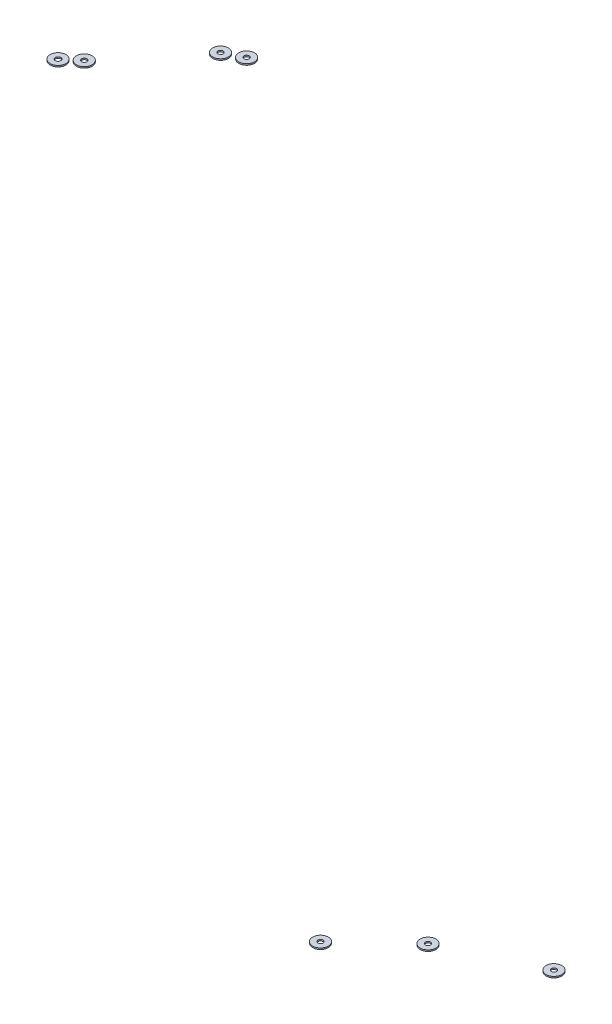
ISO-10303-21;
HEADER;
FILE_DESCRIPTION(('STEP AP214'),'2;1');
FILE_NAME('part.step','',(''),(''),'','','');
FILE_SCHEMA(('AUTOMOTIVE_DESIGN { 1 0 10303 214 1 1 1 1 }'));
ENDSEC;
DATA;
#1=APPLICATION_CONTEXT('core data for automotive mechanical design processes');
#2=APPLICATION_PROTOCOL_DEFINITION('international standard','automotive_design',2000,#1);
#3=PRODUCT_CONTEXT('',#1,'mechanical');
#4=PRODUCT('Part','Part','',(#3));
#5=PRODUCT_RELATED_PRODUCT_CATEGORY('part','',(#4));
#6=PRODUCT_DEFINITION_FORMATION('','',#4);
#7=PRODUCT_DEFINITION_CONTEXT('part definition',#1,'design');
#8=PRODUCT_DEFINITION('design','',#6,#7);
#9=PRODUCT_DEFINITION_SHAPE('','',#8);
#10=(LENGTH_UNIT() NAMED_UNIT(*) SI_UNIT(.MILLI.,.METRE.));
#11=(NAMED_UNIT(*) PLANE_ANGLE_UNIT() SI_UNIT($,.RADIAN.));
#12=(NAMED_UNIT(*) SI_UNIT($,.STERADIAN.) SOLID_ANGLE_UNIT());
#13=UNCERTAINTY_MEASURE_WITH_UNIT(LENGTH_MEASURE(1.E-05),#10,'distance_accuracy_value','');
#14=(GEOMETRIC_REPRESENTATION_CONTEXT(3) GLOBAL_UNCERTAINTY_ASSIGNED_CONTEXT((#13)) GLOBAL_UNIT_ASSIGNED_CONTEXT((#10,
#11,#12)) REPRESENTATION_CONTEXT('',''));
#15=CARTESIAN_POINT('',(0.,0.,0.));
#16=DIRECTION('',(0.,0.,1.));
#17=DIRECTION('',(1.,0.,0.));
#18=AXIS2_PLACEMENT_3D('',#15,#16,#17);
#19=CARTESIAN_POINT('',(-289.687055909534,293.9,282.424125212571));
#20=DIRECTION('',(0.,-1.,0.));
#21=DIRECTION('',(0.,0.,-1.));
#22=AXIS2_PLACEMENT_3D('',#19,#20,#21);
#23=PLANE('',#22);
#24=CARTESIAN_POINT('',(-289.687055909534,293.9,282.424125212571));
#25=DIRECTION('',(0.,-1.,0.));
#26=DIRECTION('',(0.,0.,-1.));
#27=AXIS2_PLACEMENT_3D('',#24,#25,#26);
#28=CIRCLE('',#27,4.50000000000002);
#29=CARTESIAN_POINT('',(-289.687055909534,293.9,277.924125212571));
#30=VERTEX_POINT('',#29);
#31=EDGE_CURVE('E11',#30,#30,#28,.T.);
#32=ORIENTED_EDGE('',*,*,#31,.T.);
#33=EDGE_LOOP('',(#32));
#34=FACE_BOUND('',#33,.T.);
#35=CARTESIAN_POINT('',(-289.687055909534,293.9,282.424125212571));
#36=DIRECTION('',(0.,-1.,0.));
#37=DIRECTION('',(0.,0.,-1.));
#38=AXIS2_PLACEMENT_3D('',#35,#36,#37);
#39=CIRCLE('',#38,1.50000000000002);
#40=CARTESIAN_POINT('',(-289.687055909534,293.9,280.924125212571));
#41=VERTEX_POINT('',#40);
#42=EDGE_CURVE('E53',#41,#41,#39,.T.);
#43=ORIENTED_EDGE('',*,*,#42,.F.);
#44=EDGE_LOOP('',(#43));
#45=FACE_BOUND('',#44,.T.);
#46=ADVANCED_FACE('F42',(#34,#45),#23,.T.);
#47=CARTESIAN_POINT('',(-289.687055909534,294.7,282.424125212571));
#48=DIRECTION('',(0.,-1.,0.));
#49=DIRECTION('',(0.,0.,-1.));
#50=AXIS2_PLACEMENT_3D('',#47,#48,#49);
#51=PLANE('',#50);
#52=CARTESIAN_POINT('',(-289.687055909534,294.7,282.424125212571));
#53=DIRECTION('',(0.,-1.,0.));
#54=DIRECTION('',(0.,0.,-1.));
#55=AXIS2_PLACEMENT_3D('',#52,#53,#54);
#56=CIRCLE('',#55,4.50000000000002);
#57=CARTESIAN_POINT('',(-289.687055909534,294.7,277.924125212571));
#58=VERTEX_POINT('',#57);
#59=EDGE_CURVE('E46',#58,#58,#56,.T.);
#60=ORIENTED_EDGE('',*,*,#59,.F.);
#61=EDGE_LOOP('',(#60));
#62=FACE_BOUND('',#61,.T.);
#63=CARTESIAN_POINT('',(-289.687055909534,294.7,282.424125212571));
#64=DIRECTION('',(0.,-1.,0.));
#65=DIRECTION('',(0.,0.,-1.));
#66=AXIS2_PLACEMENT_3D('',#63,#64,#65);
#67=CIRCLE('',#66,1.50000000000002);
#68=CARTESIAN_POINT('',(-289.687055909534,294.7,280.924125212571));
#69=VERTEX_POINT('',#68);
#70=EDGE_CURVE('E55',#69,#69,#67,.T.);
#71=ORIENTED_EDGE('',*,*,#70,.T.);
#72=EDGE_LOOP('',(#71));
#73=FACE_BOUND('',#72,.T.);
#74=ADVANCED_FACE('F65',(#62,#73),#51,.F.);
#75=CARTESIAN_POINT('',(-289.687055909534,293.9,282.424125212571));
#76=DIRECTION('',(0.,1.,0.));
#77=DIRECTION('',(0.,0.,1.));
#78=AXIS2_PLACEMENT_3D('',#75,#76,#77);
#79=CYLINDRICAL_SURFACE('',#78,4.50000000000002);
#80=ORIENTED_EDGE('',*,*,#31,.F.);
#81=EDGE_LOOP('',(#80));
#82=FACE_BOUND('',#81,.T.);
#83=ORIENTED_EDGE('',*,*,#59,.T.);
#84=EDGE_LOOP('',(#83));
#85=FACE_BOUND('',#84,.T.);
#86=ADVANCED_FACE('F44',(#82,#85),#79,.T.);
#87=CARTESIAN_POINT('',(-289.687055909534,293.9,282.424125212571));
#88=DIRECTION('',(0.,1.,0.));
#89=DIRECTION('',(0.,0.,1.));
#90=AXIS2_PLACEMENT_3D('',#87,#88,#89);
#91=CYLINDRICAL_SURFACE('',#90,1.50000000000002);
#92=ORIENTED_EDGE('',*,*,#42,.T.);
#93=EDGE_LOOP('',(#92));
#94=FACE_BOUND('',#93,.T.);
#95=ORIENTED_EDGE('',*,*,#70,.F.);
#96=EDGE_LOOP('',(#95));
#97=FACE_BOUND('',#96,.T.);
#98=ADVANCED_FACE('F61',(#94,#97),#91,.F.);
#99=CLOSED_SHELL('',(#46,#74,#86,#98));
#100=MANIFOLD_SOLID_BREP('B2',#99);
#101=CARTESIAN_POINT('',(-339.082998520851,293.9,305.429754445409));
#102=DIRECTION('',(0.,-1.,0.));
#103=DIRECTION('',(0.,0.,-1.));
#104=AXIS2_PLACEMENT_3D('',#101,#102,#103);
#105=PLANE('',#104);
#106=CARTESIAN_POINT('',(-339.082998520851,293.9,305.429754445409));
#107=DIRECTION('',(0.,-1.,0.));
#108=DIRECTION('',(0.,0.,-1.));
#109=AXIS2_PLACEMENT_3D('',#106,#107,#108);
#110=CIRCLE('',#109,4.50000000000002);
#111=CARTESIAN_POINT('',(-339.082998520851,293.9,300.929754445409));
#112=VERTEX_POINT('',#111);
#113=EDGE_CURVE('E41',#112,#112,#110,.T.);
#114=ORIENTED_EDGE('',*,*,#113,.T.);
#115=EDGE_LOOP('',(#114));
#116=FACE_BOUND('',#115,.T.);
#117=CARTESIAN_POINT('',(-339.082998520851,293.9,305.429754445409));
#118=DIRECTION('',(0.,-1.,0.));
#119=DIRECTION('',(0.,0.,-1.));
#120=AXIS2_PLACEMENT_3D('',#117,#118,#119);
#121=CIRCLE('',#120,1.50000000000002);
#122=CARTESIAN_POINT('',(-339.082998520851,293.9,303.929754445409));
#123=VERTEX_POINT('',#122);
#124=EDGE_CURVE('E123',#123,#123,#121,.T.);
#125=ORIENTED_EDGE('',*,*,#124,.F.);
#126=EDGE_LOOP('',(#125));
#127=FACE_BOUND('',#126,.T.);
#128=ADVANCED_FACE('F112',(#116,#127),#105,.T.);
#129=CARTESIAN_POINT('',(-339.082998520851,294.7,305.429754445409));
#130=DIRECTION('',(0.,-1.,0.));
#131=DIRECTION('',(0.,0.,-1.));
#132=AXIS2_PLACEMENT_3D('',#129,#130,#131);
#133=PLANE('',#132);
#134=CARTESIAN_POINT('',(-339.082998520851,294.7,305.429754445409));
#135=DIRECTION('',(0.,-1.,0.));
#136=DIRECTION('',(0.,0.,-1.));
#137=AXIS2_PLACEMENT_3D('',#134,#135,#136);
#138=CIRCLE('',#137,4.50000000000002);
#139=CARTESIAN_POINT('',(-339.082998520851,294.7,300.929754445409));
#140=VERTEX_POINT('',#139);
#141=EDGE_CURVE('E116',#140,#140,#138,.T.);
#142=ORIENTED_EDGE('',*,*,#141,.F.);
#143=EDGE_LOOP('',(#142));
#144=FACE_BOUND('',#143,.T.);
#145=CARTESIAN_POINT('',(-339.082998520851,294.7,305.429754445409));
#146=DIRECTION('',(0.,-1.,0.));
#147=DIRECTION('',(0.,0.,-1.));
#148=AXIS2_PLACEMENT_3D('',#145,#146,#147);
#149=CIRCLE('',#148,1.50000000000002);
#150=CARTESIAN_POINT('',(-339.082998520851,294.7,303.929754445409));
#151=VERTEX_POINT('',#150);
#152=EDGE_CURVE('E125',#151,#151,#149,.T.);
#153=ORIENTED_EDGE('',*,*,#152,.T.);
#154=EDGE_LOOP('',(#153));
#155=FACE_BOUND('',#154,.T.);
#156=ADVANCED_FACE('F135',(#144,#155),#133,.F.);
#157=CARTESIAN_POINT('',(-339.082998520851,293.9,305.429754445409));
#158=DIRECTION('',(0.,1.,0.));
#159=DIRECTION('',(0.,0.,1.));
#160=AXIS2_PLACEMENT_3D('',#157,#158,#159);
#161=CYLINDRICAL_SURFACE('',#160,4.50000000000002);
#162=ORIENTED_EDGE('',*,*,#113,.F.);
#163=EDGE_LOOP('',(#162));
#164=FACE_BOUND('',#163,.T.);
#165=ORIENTED_EDGE('',*,*,#141,.T.);
#166=EDGE_LOOP('',(#165));
#167=FACE_BOUND('',#166,.T.);
#168=ADVANCED_FACE('F114',(#164,#167),#161,.T.);
#169=CARTESIAN_POINT('',(-339.082998520851,293.9,305.429754445409));
#170=DIRECTION('',(0.,1.,0.));
#171=DIRECTION('',(0.,0.,1.));
#172=AXIS2_PLACEMENT_3D('',#169,#170,#171);
#173=CYLINDRICAL_SURFACE('',#172,1.50000000000002);
#174=ORIENTED_EDGE('',*,*,#124,.T.);
#175=EDGE_LOOP('',(#174));
#176=FACE_BOUND('',#175,.T.);
#177=ORIENTED_EDGE('',*,*,#152,.F.);
#178=EDGE_LOOP('',(#177));
#179=FACE_BOUND('',#178,.T.);
#180=ADVANCED_FACE('F131',(#176,#179),#173,.F.);
#181=CLOSED_SHELL('',(#128,#156,#168,#180));
#182=MANIFOLD_SOLID_BREP('B6',#181);
#183=CARTESIAN_POINT('',(-370.956911026411,293.9,335.367132453118));
#184=DIRECTION('',(0.,-1.,0.));
#185=DIRECTION('',(0.,0.,-1.));
#186=AXIS2_PLACEMENT_3D('',#183,#184,#185);
#187=PLANE('',#186);
#188=CARTESIAN_POINT('',(-370.956911026411,293.9,335.367132453118));
#189=DIRECTION('',(0.,-1.,0.));
#190=DIRECTION('',(0.,0.,-1.));
#191=AXIS2_PLACEMENT_3D('',#188,#189,#190);
#192=CIRCLE('',#191,4.50000000000002);
#193=CARTESIAN_POINT('',(-370.956911026411,293.9,330.867132453118));
#194=VERTEX_POINT('',#193);
#195=EDGE_CURVE('E111',#194,#194,#192,.T.);
#196=ORIENTED_EDGE('',*,*,#195,.T.);
#197=EDGE_LOOP('',(#196));
#198=FACE_BOUND('',#197,.T.);
#199=CARTESIAN_POINT('',(-370.956911026411,293.9,335.367132453118));
#200=DIRECTION('',(0.,-1.,0.));
#201=DIRECTION('',(0.,0.,-1.));
#202=AXIS2_PLACEMENT_3D('',#199,#200,#201);
#203=CIRCLE('',#202,1.50000000000002);
#204=CARTESIAN_POINT('',(-370.956911026411,293.9,333.867132453118));
#205=VERTEX_POINT('',#204);
#206=EDGE_CURVE('E193',#205,#205,#203,.T.);
#207=ORIENTED_EDGE('',*,*,#206,.F.);
#208=EDGE_LOOP('',(#207));
#209=FACE_BOUND('',#208,.T.);
#210=ADVANCED_FACE('F182',(#198,#209),#187,.T.);
#211=CARTESIAN_POINT('',(-370.956911026411,294.7,335.367132453118));
#212=DIRECTION('',(0.,-1.,0.));
#213=DIRECTION('',(0.,0.,-1.));
#214=AXIS2_PLACEMENT_3D('',#211,#212,#213);
#215=PLANE('',#214);
#216=CARTESIAN_POINT('',(-370.956911026411,294.7,335.367132453118));
#217=DIRECTION('',(0.,-1.,0.));
#218=DIRECTION('',(0.,0.,-1.));
#219=AXIS2_PLACEMENT_3D('',#216,#217,#218);
#220=CIRCLE('',#219,4.50000000000002);
#221=CARTESIAN_POINT('',(-370.956911026411,294.7,330.867132453118));
#222=VERTEX_POINT('',#221);
#223=EDGE_CURVE('E186',#222,#222,#220,.T.);
#224=ORIENTED_EDGE('',*,*,#223,.F.);
#225=EDGE_LOOP('',(#224));
#226=FACE_BOUND('',#225,.T.);
#227=CARTESIAN_POINT('',(-370.956911026411,294.7,335.367132453118));
#228=DIRECTION('',(0.,-1.,0.));
#229=DIRECTION('',(0.,0.,-1.));
#230=AXIS2_PLACEMENT_3D('',#227,#228,#229);
#231=CIRCLE('',#230,1.50000000000002);
#232=CARTESIAN_POINT('',(-370.956911026411,294.7,333.867132453118));
#233=VERTEX_POINT('',#232);
#234=EDGE_CURVE('E195',#233,#233,#231,.T.);
#235=ORIENTED_EDGE('',*,*,#234,.T.);
#236=EDGE_LOOP('',(#235));
#237=FACE_BOUND('',#236,.T.);
#238=ADVANCED_FACE('F205',(#226,#237),#215,.F.);
#239=CARTESIAN_POINT('',(-370.956911026411,293.9,335.367132453118));
#240=DIRECTION('',(0.,1.,0.));
#241=DIRECTION('',(0.,0.,1.));
#242=AXIS2_PLACEMENT_3D('',#239,#240,#241);
#243=CYLINDRICAL_SURFACE('',#242,4.50000000000002);
#244=ORIENTED_EDGE('',*,*,#195,.F.);
#245=EDGE_LOOP('',(#244));
#246=FACE_BOUND('',#245,.T.);
#247=ORIENTED_EDGE('',*,*,#223,.T.);
#248=EDGE_LOOP('',(#247));
#249=FACE_BOUND('',#248,.T.);
#250=ADVANCED_FACE('F184',(#246,#249),#243,.T.);
#251=CARTESIAN_POINT('',(-370.956911026411,293.9,335.367132453118));
#252=DIRECTION('',(0.,1.,0.));
#253=DIRECTION('',(0.,0.,1.));
#254=AXIS2_PLACEMENT_3D('',#251,#252,#253);
#255=CYLINDRICAL_SURFACE('',#254,1.50000000000002);
#256=ORIENTED_EDGE('',*,*,#206,.T.);
#257=EDGE_LOOP('',(#256));
#258=FACE_BOUND('',#257,.T.);
#259=ORIENTED_EDGE('',*,*,#234,.F.);
#260=EDGE_LOOP('',(#259));
#261=FACE_BOUND('',#260,.T.);
#262=ADVANCED_FACE('F201',(#258,#261),#255,.F.);
#263=CLOSED_SHELL('',(#210,#238,#250,#262));
#264=MANIFOLD_SOLID_BREP('B36',#263);
#265=CARTESIAN_POINT('',(-474.449169572246,706.1,382.793687092254));
#266=DIRECTION('',(0.,1.,0.));
#267=DIRECTION('',(0.,0.,1.));
#268=AXIS2_PLACEMENT_3D('',#265,#266,#267);
#269=PLANE('',#268);
#270=CARTESIAN_POINT('',(-474.449169572246,706.1,382.793687092254));
#271=DIRECTION('',(0.,1.,0.));
#272=DIRECTION('',(0.,0.,1.));
#273=AXIS2_PLACEMENT_3D('',#270,#271,#272);
#274=CIRCLE('',#273,4.50000000000002);
#275=CARTESIAN_POINT('',(-474.449169572246,706.1,387.293687092254));
#276=VERTEX_POINT('',#275);
#277=EDGE_CURVE('E181',#276,#276,#274,.T.);
#278=ORIENTED_EDGE('',*,*,#277,.T.);
#279=EDGE_LOOP('',(#278));
#280=FACE_BOUND('',#279,.T.);
#281=CARTESIAN_POINT('',(-474.449169572246,706.1,382.793687092254));
#282=DIRECTION('',(0.,1.,0.));
#283=DIRECTION('',(0.,0.,1.));
#284=AXIS2_PLACEMENT_3D('',#281,#282,#283);
#285=CIRCLE('',#284,1.6059145248098);
#286=CARTESIAN_POINT('',(-474.449169572246,706.1,384.399601617063));
#287=VERTEX_POINT('',#286);
#288=EDGE_CURVE('E263',#287,#287,#285,.T.);
#289=ORIENTED_EDGE('',*,*,#288,.F.);
#290=EDGE_LOOP('',(#289));
#291=FACE_BOUND('',#290,.T.);
#292=ADVANCED_FACE('F252',(#280,#291),#269,.T.);
#293=CARTESIAN_POINT('',(-474.449169572246,705.3,382.793687092254));
#294=DIRECTION('',(0.,1.,0.));
#295=DIRECTION('',(0.,0.,1.));
#296=AXIS2_PLACEMENT_3D('',#293,#294,#295);
#297=PLANE('',#296);
#298=CARTESIAN_POINT('',(-474.449169572246,705.3,382.793687092254));
#299=DIRECTION('',(0.,1.,0.));
#300=DIRECTION('',(0.,0.,1.));
#301=AXIS2_PLACEMENT_3D('',#298,#299,#300);
#302=CIRCLE('',#301,4.50000000000002);
#303=CARTESIAN_POINT('',(-474.449169572246,705.3,387.293687092254));
#304=VERTEX_POINT('',#303);
#305=EDGE_CURVE('E256',#304,#304,#302,.T.);
#306=ORIENTED_EDGE('',*,*,#305,.F.);
#307=EDGE_LOOP('',(#306));
#308=FACE_BOUND('',#307,.T.);
#309=CARTESIAN_POINT('',(-474.449169572246,705.3,382.793687092254));
#310=DIRECTION('',(0.,1.,0.));
#311=DIRECTION('',(0.,0.,1.));
#312=AXIS2_PLACEMENT_3D('',#309,#310,#311);
#313=CIRCLE('',#312,1.6059145248098);
#314=CARTESIAN_POINT('',(-474.449169572246,705.3,384.399601617063));
#315=VERTEX_POINT('',#314);
#316=EDGE_CURVE('E265',#315,#315,#313,.T.);
#317=ORIENTED_EDGE('',*,*,#316,.T.);
#318=EDGE_LOOP('',(#317));
#319=FACE_BOUND('',#318,.T.);
#320=ADVANCED_FACE('F275',(#308,#319),#297,.F.);
#321=CARTESIAN_POINT('',(-474.449169572246,706.1,382.793687092254));
#322=DIRECTION('',(0.,-1.,0.));
#323=DIRECTION('',(0.,0.,-1.));
#324=AXIS2_PLACEMENT_3D('',#321,#322,#323);
#325=CYLINDRICAL_SURFACE('',#324,4.50000000000002);
#326=ORIENTED_EDGE('',*,*,#277,.F.);
#327=EDGE_LOOP('',(#326));
#328=FACE_BOUND('',#327,.T.);
#329=ORIENTED_EDGE('',*,*,#305,.T.);
#330=EDGE_LOOP('',(#329));
#331=FACE_BOUND('',#330,.T.);
#332=ADVANCED_FACE('F254',(#328,#331),#325,.T.);
#333=CARTESIAN_POINT('',(-474.449169572246,706.1,382.793687092254));
#334=DIRECTION('',(0.,-1.,0.));
#335=DIRECTION('',(0.,0.,-1.));
#336=AXIS2_PLACEMENT_3D('',#333,#334,#335);
#337=CYLINDRICAL_SURFACE('',#336,1.6059145248098);
#338=ORIENTED_EDGE('',*,*,#288,.T.);
#339=EDGE_LOOP('',(#338));
#340=FACE_BOUND('',#339,.T.);
#341=ORIENTED_EDGE('',*,*,#316,.F.);
#342=EDGE_LOOP('',(#341));
#343=FACE_BOUND('',#342,.T.);
#344=ADVANCED_FACE('F271',(#340,#343),#337,.F.);
#345=CLOSED_SHELL('',(#292,#320,#332,#344));
#346=MANIFOLD_SOLID_BREP('B106',#345);
#347=CARTESIAN_POINT('',(-466.308050673724,706.1,375.859415010098));
#348=DIRECTION('',(0.,1.,0.));
#349=DIRECTION('',(0.,0.,1.));
#350=AXIS2_PLACEMENT_3D('',#347,#348,#349);
#351=PLANE('',#350);
#352=CARTESIAN_POINT('',(-466.308050673724,706.1,375.859415010098));
#353=DIRECTION('',(0.,1.,0.));
#354=DIRECTION('',(0.,0.,1.));
#355=AXIS2_PLACEMENT_3D('',#352,#353,#354);
#356=CIRCLE('',#355,4.50000000000002);
#357=CARTESIAN_POINT('',(-466.308050673724,706.1,380.359415010098));
#358=VERTEX_POINT('',#357);
#359=EDGE_CURVE('E251',#358,#358,#356,.T.);
#360=ORIENTED_EDGE('',*,*,#359,.T.);
#361=EDGE_LOOP('',(#360));
#362=FACE_BOUND('',#361,.T.);
#363=CARTESIAN_POINT('',(-466.308050673724,706.1,375.859415010098));
#364=DIRECTION('',(0.,1.,0.));
#365=DIRECTION('',(0.,0.,1.));
#366=AXIS2_PLACEMENT_3D('',#363,#364,#365);
#367=CIRCLE('',#366,1.50000000000002);
#368=CARTESIAN_POINT('',(-466.308050673724,706.1,377.359415010098));
#369=VERTEX_POINT('',#368);
#370=EDGE_CURVE('E333',#369,#369,#367,.T.);
#371=ORIENTED_EDGE('',*,*,#370,.F.);
#372=EDGE_LOOP('',(#371));
#373=FACE_BOUND('',#372,.T.);
#374=ADVANCED_FACE('F322',(#362,#373),#351,.T.);
#375=CARTESIAN_POINT('',(-466.308050673724,705.3,375.859415010098));
#376=DIRECTION('',(0.,1.,0.));
#377=DIRECTION('',(0.,0.,1.));
#378=AXIS2_PLACEMENT_3D('',#375,#376,#377);
#379=PLANE('',#378);
#380=CARTESIAN_POINT('',(-466.308050673724,705.3,375.859415010098));
#381=DIRECTION('',(0.,1.,0.));
#382=DIRECTION('',(0.,0.,1.));
#383=AXIS2_PLACEMENT_3D('',#380,#381,#382);
#384=CIRCLE('',#383,4.50000000000002);
#385=CARTESIAN_POINT('',(-466.308050673724,705.3,380.359415010098));
#386=VERTEX_POINT('',#385);
#387=EDGE_CURVE('E326',#386,#386,#384,.T.);
#388=ORIENTED_EDGE('',*,*,#387,.F.);
#389=EDGE_LOOP('',(#388));
#390=FACE_BOUND('',#389,.T.);
#391=CARTESIAN_POINT('',(-466.308050673724,705.3,375.859415010098));
#392=DIRECTION('',(0.,1.,0.));
#393=DIRECTION('',(0.,0.,1.));
#394=AXIS2_PLACEMENT_3D('',#391,#392,#393);
#395=CIRCLE('',#394,1.50000000000002);
#396=CARTESIAN_POINT('',(-466.308050673724,705.3,377.359415010098));
#397=VERTEX_POINT('',#396);
#398=EDGE_CURVE('E335',#397,#397,#395,.T.);
#399=ORIENTED_EDGE('',*,*,#398,.T.);
#400=EDGE_LOOP('',(#399));
#401=FACE_BOUND('',#400,.T.);
#402=ADVANCED_FACE('F345',(#390,#401),#379,.F.);
#403=CARTESIAN_POINT('',(-466.308050673724,706.1,375.859415010098));
#404=DIRECTION('',(0.,-1.,0.));
#405=DIRECTION('',(0.,0.,-1.));
#406=AXIS2_PLACEMENT_3D('',#403,#404,#405);
#407=CYLINDRICAL_SURFACE('',#406,4.50000000000002);
#408=ORIENTED_EDGE('',*,*,#359,.F.);
#409=EDGE_LOOP('',(#408));
#410=FACE_BOUND('',#409,.T.);
#411=ORIENTED_EDGE('',*,*,#387,.T.);
#412=EDGE_LOOP('',(#411));
#413=FACE_BOUND('',#412,.T.);
#414=ADVANCED_FACE('F324',(#410,#413),#407,.T.);
#415=CARTESIAN_POINT('',(-466.308050673724,706.1,375.859415010098));
#416=DIRECTION('',(0.,-1.,0.));
#417=DIRECTION('',(0.,0.,-1.));
#418=AXIS2_PLACEMENT_3D('',#415,#416,#417);
#419=CYLINDRICAL_SURFACE('',#418,1.50000000000002);
#420=ORIENTED_EDGE('',*,*,#370,.T.);
#421=EDGE_LOOP('',(#420));
#422=FACE_BOUND('',#421,.T.);
#423=ORIENTED_EDGE('',*,*,#398,.F.);
#424=EDGE_LOOP('',(#423));
#425=FACE_BOUND('',#424,.T.);
#426=ADVANCED_FACE('F341',(#422,#425),#419,.F.);
#427=CLOSED_SHELL('',(#374,#402,#414,#426));
#428=MANIFOLD_SOLID_BREP('B176',#427);
#429=CARTESIAN_POINT('',(-431.039698401952,706.1,332.774189517311));
#430=DIRECTION('',(0.,1.,0.));
#431=DIRECTION('',(0.,0.,1.));
#432=AXIS2_PLACEMENT_3D('',#429,#430,#431);
#433=PLANE('',#432);
#434=CARTESIAN_POINT('',(-431.039698401952,706.1,332.774189517311));
#435=DIRECTION('',(0.,1.,0.));
#436=DIRECTION('',(0.,0.,1.));
#437=AXIS2_PLACEMENT_3D('',#434,#435,#436);
#438=CIRCLE('',#437,4.50000000000002);
#439=CARTESIAN_POINT('',(-431.039698401952,706.1,337.274189517311));
#440=VERTEX_POINT('',#439);
#441=EDGE_CURVE('E321',#440,#440,#438,.T.);
#442=ORIENTED_EDGE('',*,*,#441,.T.);
#443=EDGE_LOOP('',(#442));
#444=FACE_BOUND('',#443,.T.);
#445=CARTESIAN_POINT('',(-431.039698401952,706.1,332.774189517311));
#446=DIRECTION('',(0.,1.,0.));
#447=DIRECTION('',(0.,0.,1.));
#448=AXIS2_PLACEMENT_3D('',#445,#446,#447);
#449=CIRCLE('',#448,1.49999999999997);
#450=CARTESIAN_POINT('',(-431.039698401952,706.1,334.274189517311));
#451=VERTEX_POINT('',#450);
#452=EDGE_CURVE('E402',#451,#451,#449,.T.);
#453=ORIENTED_EDGE('',*,*,#452,.F.);
#454=EDGE_LOOP('',(#453));
#455=FACE_BOUND('',#454,.T.);
#456=ADVANCED_FACE('F391',(#444,#455),#433,.T.);
#457=CARTESIAN_POINT('',(-431.039698401952,705.3,332.774189517311));
#458=DIRECTION('',(0.,1.,0.));
#459=DIRECTION('',(0.,0.,1.));
#460=AXIS2_PLACEMENT_3D('',#457,#458,#459);
#461=PLANE('',#460);
#462=CARTESIAN_POINT('',(-431.039698401952,705.3,332.774189517311));
#463=DIRECTION('',(0.,1.,0.));
#464=DIRECTION('',(0.,0.,1.));
#465=AXIS2_PLACEMENT_3D('',#462,#463,#464);
#466=CIRCLE('',#465,4.50000000000002);
#467=CARTESIAN_POINT('',(-431.039698401952,705.3,337.274189517311));
#468=VERTEX_POINT('',#467);
#469=EDGE_CURVE('E395',#468,#468,#466,.T.);
#470=ORIENTED_EDGE('',*,*,#469,.F.);
#471=EDGE_LOOP('',(#470));
#472=FACE_BOUND('',#471,.T.);
#473=CARTESIAN_POINT('',(-431.039698401952,705.3,332.774189517311));
#474=DIRECTION('',(0.,1.,0.));
#475=DIRECTION('',(0.,0.,1.));
#476=AXIS2_PLACEMENT_3D('',#473,#474,#475);
#477=CIRCLE('',#476,1.49999999999997);
#478=CARTESIAN_POINT('',(-431.039698401952,705.3,334.274189517311));
#479=VERTEX_POINT('',#478);
#480=EDGE_CURVE('E404',#479,#479,#477,.T.);
#481=ORIENTED_EDGE('',*,*,#480,.T.);
#482=EDGE_LOOP('',(#481));
#483=FACE_BOUND('',#482,.T.);
#484=ADVANCED_FACE('F414',(#472,#483),#461,.F.);
#485=CARTESIAN_POINT('',(-431.039698401952,706.1,332.774189517311));
#486=DIRECTION('',(0.,-1.,0.));
#487=DIRECTION('',(0.,0.,-1.));
#488=AXIS2_PLACEMENT_3D('',#485,#486,#487);
#489=CYLINDRICAL_SURFACE('',#488,4.50000000000002);
#490=ORIENTED_EDGE('',*,*,#441,.F.);
#491=EDGE_LOOP('',(#490));
#492=FACE_BOUND('',#491,.T.);
#493=ORIENTED_EDGE('',*,*,#469,.T.);
#494=EDGE_LOOP('',(#493));
#495=FACE_BOUND('',#494,.T.);
#496=ADVANCED_FACE('F393',(#492,#495),#489,.T.);
#497=CARTESIAN_POINT('',(-431.039698401952,706.1,332.774189517311));
#498=DIRECTION('',(0.,-1.,0.));
#499=DIRECTION('',(0.,0.,-1.));
#500=AXIS2_PLACEMENT_3D('',#497,#498,#499);
#501=CYLINDRICAL_SURFACE('',#500,1.49999999999997);
#502=ORIENTED_EDGE('',*,*,#452,.T.);
#503=EDGE_LOOP('',(#502));
#504=FACE_BOUND('',#503,.T.);
#505=ORIENTED_EDGE('',*,*,#480,.F.);
#506=EDGE_LOOP('',(#505));
#507=FACE_BOUND('',#506,.T.);
#508=ADVANCED_FACE('F410',(#504,#507),#501,.F.);
#509=CLOSED_SHELL('',(#456,#484,#496,#508));
#510=MANIFOLD_SOLID_BREP('B246',#509);
#511=CARTESIAN_POINT('',(-421.090050281492,706.1,327.725114351705));
#512=DIRECTION('',(0.,1.,0.));
#513=DIRECTION('',(0.,0.,1.));
#514=AXIS2_PLACEMENT_3D('',#511,#512,#513);
#515=PLANE('',#514);
#516=CARTESIAN_POINT('',(-421.090050281492,706.1,327.725114351705));
#517=DIRECTION('',(0.,1.,0.));
#518=DIRECTION('',(0.,0.,1.));
#519=AXIS2_PLACEMENT_3D('',#516,#517,#518);
#520=CIRCLE('',#519,4.50000000000002);
#521=CARTESIAN_POINT('',(-421.090050281492,706.1,332.225114351705));
#522=VERTEX_POINT('',#521);
#523=EDGE_CURVE('E390',#522,#522,#520,.T.);
#524=ORIENTED_EDGE('',*,*,#523,.T.);
#525=EDGE_LOOP('',(#524));
#526=FACE_BOUND('',#525,.T.);
#527=CARTESIAN_POINT('',(-421.090050281492,706.1,327.725114351705));
#528=DIRECTION('',(0.,1.,0.));
#529=DIRECTION('',(0.,0.,1.));
#530=AXIS2_PLACEMENT_3D('',#527,#528,#529);
#531=CIRCLE('',#530,1.49999999999997);
#532=CARTESIAN_POINT('',(-421.090050281492,706.1,329.225114351705));
#533=VERTEX_POINT('',#532);
#534=EDGE_CURVE('E464',#533,#533,#531,.T.);
#535=ORIENTED_EDGE('',*,*,#534,.F.);
#536=EDGE_LOOP('',(#535));
#537=FACE_BOUND('',#536,.T.);
#538=ADVANCED_FACE('F453',(#526,#537),#515,.T.);
#539=CARTESIAN_POINT('',(-421.090050281492,705.3,327.725114351705));
#540=DIRECTION('',(0.,1.,0.));
#541=DIRECTION('',(0.,0.,1.));
#542=AXIS2_PLACEMENT_3D('',#539,#540,#541);
#543=PLANE('',#542);
#544=CARTESIAN_POINT('',(-421.090050281492,705.3,327.725114351705));
#545=DIRECTION('',(0.,1.,0.));
#546=DIRECTION('',(0.,0.,1.));
#547=AXIS2_PLACEMENT_3D('',#544,#545,#546);
#548=CIRCLE('',#547,4.50000000000002);
#549=CARTESIAN_POINT('',(-421.090050281492,705.3,332.225114351705));
#550=VERTEX_POINT('',#549);
#551=EDGE_CURVE('E457',#550,#550,#548,.T.);
#552=ORIENTED_EDGE('',*,*,#551,.F.);
#553=EDGE_LOOP('',(#552));
#554=FACE_BOUND('',#553,.T.);
#555=CARTESIAN_POINT('',(-421.090050281492,705.3,327.725114351705));
#556=DIRECTION('',(0.,1.,0.));
#557=DIRECTION('',(0.,0.,1.));
#558=AXIS2_PLACEMENT_3D('',#555,#556,#557);
#559=CIRCLE('',#558,1.49999999999997);
#560=CARTESIAN_POINT('',(-421.090050281492,705.3,329.225114351705));
#561=VERTEX_POINT('',#560);
#562=EDGE_CURVE('E466',#561,#561,#559,.T.);
#563=ORIENTED_EDGE('',*,*,#562,.T.);
#564=EDGE_LOOP('',(#563));
#565=FACE_BOUND('',#564,.T.);
#566=ADVANCED_FACE('F476',(#554,#565),#543,.F.);
#567=CARTESIAN_POINT('',(-421.090050281492,706.1,327.725114351705));
#568=DIRECTION('',(0.,-1.,0.));
#569=DIRECTION('',(0.,0.,-1.));
#570=AXIS2_PLACEMENT_3D('',#567,#568,#569);
#571=CYLINDRICAL_SURFACE('',#570,4.50000000000002);
#572=ORIENTED_EDGE('',*,*,#523,.F.);
#573=EDGE_LOOP('',(#572));
#574=FACE_BOUND('',#573,.T.);
#575=ORIENTED_EDGE('',*,*,#551,.T.);
#576=EDGE_LOOP('',(#575));
#577=FACE_BOUND('',#576,.T.);
#578=ADVANCED_FACE('F455',(#574,#577),#571,.T.);
#579=CARTESIAN_POINT('',(-421.090050281492,706.1,327.725114351705));
#580=DIRECTION('',(0.,-1.,0.));
#581=DIRECTION('',(0.,0.,-1.));
#582=AXIS2_PLACEMENT_3D('',#579,#580,#581);
#583=CYLINDRICAL_SURFACE('',#582,1.49999999999997);
#584=ORIENTED_EDGE('',*,*,#534,.T.);
#585=EDGE_LOOP('',(#584));
#586=FACE_BOUND('',#585,.T.);
#587=ORIENTED_EDGE('',*,*,#562,.F.);
#588=EDGE_LOOP('',(#587));
#589=FACE_BOUND('',#588,.T.);
#590=ADVANCED_FACE('F472',(#586,#589),#583,.F.);
#591=CLOSED_SHELL('',(#538,#566,#578,#590));
#592=MANIFOLD_SOLID_BREP('B316',#591);
#593=ADVANCED_BREP_SHAPE_REPRESENTATION('',(#18,#100,#182,#264,#346,#428,#510,#592),#14);
#594=SHAPE_DEFINITION_REPRESENTATION(#9,#593);
ENDSEC;
END-ISO-10303-21;
